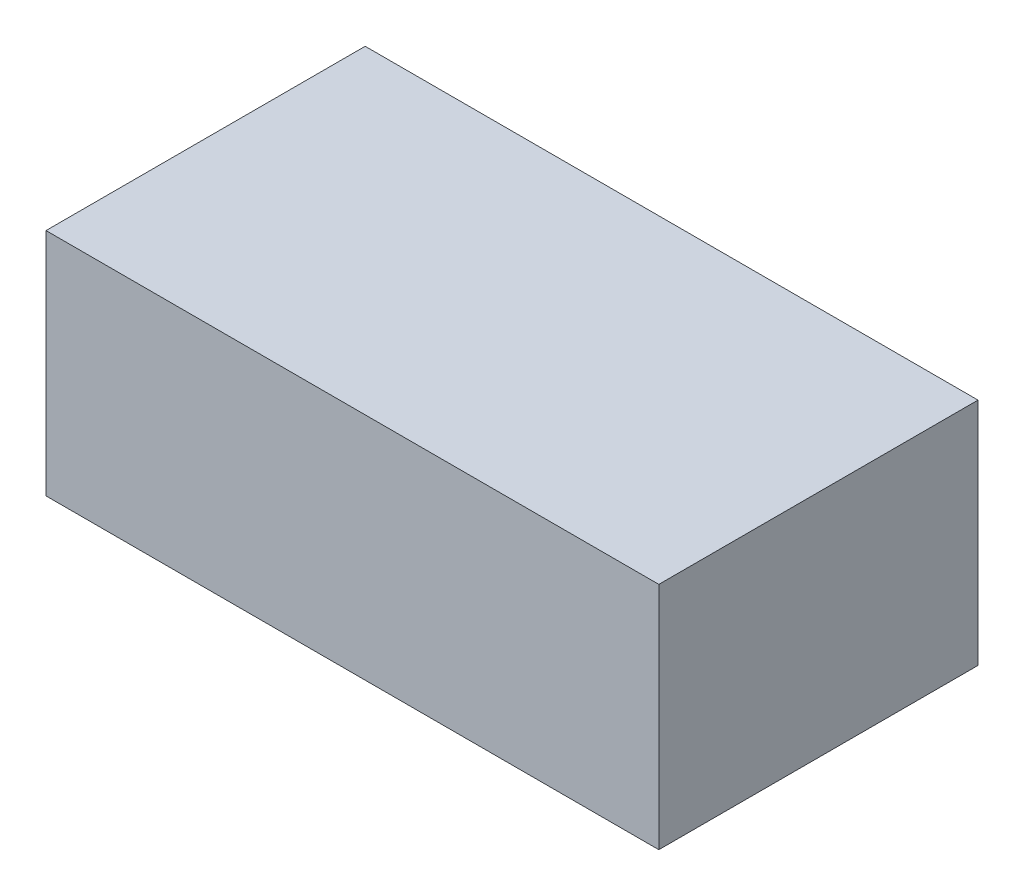
ISO-10303-21;
HEADER;
FILE_DESCRIPTION(('STEP AP214'),'2;1');
FILE_NAME('part.step','',(''),(''),'','','');
FILE_SCHEMA(('AUTOMOTIVE_DESIGN { 1 0 10303 214 1 1 1 1 }'));
ENDSEC;
DATA;
#1=APPLICATION_CONTEXT('core data for automotive mechanical design processes');
#2=APPLICATION_PROTOCOL_DEFINITION('international standard','automotive_design',2000,#1);
#3=PRODUCT_CONTEXT('',#1,'mechanical');
#4=PRODUCT('Part','Part','',(#3));
#5=PRODUCT_RELATED_PRODUCT_CATEGORY('part','',(#4));
#6=PRODUCT_DEFINITION_FORMATION('','',#4);
#7=PRODUCT_DEFINITION_CONTEXT('part definition',#1,'design');
#8=PRODUCT_DEFINITION('design','',#6,#7);
#9=PRODUCT_DEFINITION_SHAPE('','',#8);
#10=(LENGTH_UNIT() NAMED_UNIT(*) SI_UNIT(.MILLI.,.METRE.));
#11=(NAMED_UNIT(*) PLANE_ANGLE_UNIT() SI_UNIT($,.RADIAN.));
#12=(NAMED_UNIT(*) SI_UNIT($,.STERADIAN.) SOLID_ANGLE_UNIT());
#13=UNCERTAINTY_MEASURE_WITH_UNIT(LENGTH_MEASURE(1.E-05),#10,'distance_accuracy_value','');
#14=(GEOMETRIC_REPRESENTATION_CONTEXT(3) GLOBAL_UNCERTAINTY_ASSIGNED_CONTEXT((#13)) GLOBAL_UNIT_ASSIGNED_CONTEXT((#10,
#11,#12)) REPRESENTATION_CONTEXT('',''));
#15=CARTESIAN_POINT('',(0.,0.,0.));
#16=DIRECTION('',(0.,0.,1.));
#17=DIRECTION('',(1.,0.,0.));
#18=AXIS2_PLACEMENT_3D('',#15,#16,#17);
#19=CARTESIAN_POINT('',(-0.48,-0.18,0.));
#20=DIRECTION('',(0.,-1.,0.));
#21=DIRECTION('',(1.,0.,0.));
#22=AXIS2_PLACEMENT_3D('',#19,#20,#21);
#23=PLANE('',#22);
#24=DIRECTION('',(1.,0.,0.));
#25=VECTOR('',#24,1.);
#26=CARTESIAN_POINT('',(-0.48,-0.18,0.));
#27=LINE('',#26,#25);
#28=CARTESIAN_POINT('',(-0.48,-0.18,0.));
#29=VERTEX_POINT('',#28);
#30=CARTESIAN_POINT('',(0.48,-0.18,0.));
#31=VERTEX_POINT('',#30);
#32=EDGE_CURVE('E11',#29,#31,#27,.T.);
#33=ORIENTED_EDGE('',*,*,#32,.T.);
#34=DIRECTION('',(0.,0.,1.));
#35=VECTOR('',#34,1.);
#36=CARTESIAN_POINT('',(0.48,-0.18,0.));
#37=LINE('',#36,#35);
#38=CARTESIAN_POINT('',(0.48,-0.18,0.5));
#39=VERTEX_POINT('',#38);
#40=EDGE_CURVE('E24',#31,#39,#37,.T.);
#41=ORIENTED_EDGE('',*,*,#40,.T.);
#42=DIRECTION('',(1.,0.,0.));
#43=VECTOR('',#42,1.);
#44=CARTESIAN_POINT('',(-0.48,-0.18,0.5));
#45=LINE('',#44,#43);
#46=CARTESIAN_POINT('',(-0.48,-0.18,0.5));
#47=VERTEX_POINT('',#46);
#48=EDGE_CURVE('E75',#47,#39,#45,.T.);
#49=ORIENTED_EDGE('',*,*,#48,.F.);
#50=DIRECTION('',(0.,0.,1.));
#51=VECTOR('',#50,1.);
#52=CARTESIAN_POINT('',(-0.48,-0.18,0.));
#53=LINE('',#52,#51);
#54=EDGE_CURVE('E86',#29,#47,#53,.T.);
#55=ORIENTED_EDGE('',*,*,#54,.F.);
#56=EDGE_LOOP('',(#33,#41,#49,#55));
#57=FACE_BOUND('',#56,.T.);
#58=ADVANCED_FACE('F17',(#57),#23,.T.);
#59=CARTESIAN_POINT('',(-0.48,0.18,0.));
#60=DIRECTION('',(-1.,0.,0.));
#61=DIRECTION('',(0.,-1.,0.));
#62=AXIS2_PLACEMENT_3D('',#59,#60,#61);
#63=PLANE('',#62);
#64=DIRECTION('',(0.,-1.,0.));
#65=VECTOR('',#64,1.);
#66=CARTESIAN_POINT('',(-0.48,0.18,0.));
#67=LINE('',#66,#65);
#68=CARTESIAN_POINT('',(-0.48,0.18,0.));
#69=VERTEX_POINT('',#68);
#70=EDGE_CURVE('E83',#69,#29,#67,.T.);
#71=ORIENTED_EDGE('',*,*,#70,.T.);
#72=ORIENTED_EDGE('',*,*,#54,.T.);
#73=DIRECTION('',(0.,-1.,0.));
#74=VECTOR('',#73,1.);
#75=CARTESIAN_POINT('',(-0.48,0.18,0.5));
#76=LINE('',#75,#74);
#77=CARTESIAN_POINT('',(-0.48,0.18,0.5));
#78=VERTEX_POINT('',#77);
#79=EDGE_CURVE('E81',#78,#47,#76,.T.);
#80=ORIENTED_EDGE('',*,*,#79,.F.);
#81=DIRECTION('',(0.,0.,1.));
#82=VECTOR('',#81,1.);
#83=CARTESIAN_POINT('',(-0.48,0.18,0.));
#84=LINE('',#83,#82);
#85=EDGE_CURVE('E61',#69,#78,#84,.T.);
#86=ORIENTED_EDGE('',*,*,#85,.F.);
#87=EDGE_LOOP('',(#71,#72,#80,#86));
#88=FACE_BOUND('',#87,.T.);
#89=ADVANCED_FACE('F91',(#88),#63,.T.);
#90=CARTESIAN_POINT('',(0.48,0.18,0.));
#91=DIRECTION('',(0.,1.,0.));
#92=DIRECTION('',(-1.,0.,0.));
#93=AXIS2_PLACEMENT_3D('',#90,#91,#92);
#94=PLANE('',#93);
#95=DIRECTION('',(-1.,0.,0.));
#96=VECTOR('',#95,1.);
#97=CARTESIAN_POINT('',(0.48,0.18,0.));
#98=LINE('',#97,#96);
#99=CARTESIAN_POINT('',(0.48,0.18,0.));
#100=VERTEX_POINT('',#99);
#101=EDGE_CURVE('E65',#100,#69,#98,.T.);
#102=ORIENTED_EDGE('',*,*,#101,.T.);
#103=ORIENTED_EDGE('',*,*,#85,.T.);
#104=DIRECTION('',(-1.,0.,0.));
#105=VECTOR('',#104,1.);
#106=CARTESIAN_POINT('',(0.48,0.18,0.5));
#107=LINE('',#106,#105);
#108=CARTESIAN_POINT('',(0.48,0.18,0.5));
#109=VERTEX_POINT('',#108);
#110=EDGE_CURVE('E54',#109,#78,#107,.T.);
#111=ORIENTED_EDGE('',*,*,#110,.F.);
#112=DIRECTION('',(0.,0.,1.));
#113=VECTOR('',#112,1.);
#114=CARTESIAN_POINT('',(0.48,0.18,0.));
#115=LINE('',#114,#113);
#116=EDGE_CURVE('E58',#100,#109,#115,.T.);
#117=ORIENTED_EDGE('',*,*,#116,.F.);
#118=EDGE_LOOP('',(#102,#103,#111,#117));
#119=FACE_BOUND('',#118,.T.);
#120=ADVANCED_FACE('F57',(#119),#94,.T.);
#121=CARTESIAN_POINT('',(0.48,-0.18,0.));
#122=DIRECTION('',(1.,0.,0.));
#123=DIRECTION('',(0.,1.,0.));
#124=AXIS2_PLACEMENT_3D('',#121,#122,#123);
#125=PLANE('',#124);
#126=DIRECTION('',(0.,1.,0.));
#127=VECTOR('',#126,1.);
#128=CARTESIAN_POINT('',(0.48,-0.18,0.));
#129=LINE('',#128,#127);
#130=EDGE_CURVE('E71',#31,#100,#129,.T.);
#131=ORIENTED_EDGE('',*,*,#130,.T.);
#132=ORIENTED_EDGE('',*,*,#116,.T.);
#133=DIRECTION('',(0.,1.,0.));
#134=VECTOR('',#133,1.);
#135=CARTESIAN_POINT('',(0.48,-0.18,0.5));
#136=LINE('',#135,#134);
#137=EDGE_CURVE('E70',#39,#109,#136,.T.);
#138=ORIENTED_EDGE('',*,*,#137,.F.);
#139=ORIENTED_EDGE('',*,*,#40,.F.);
#140=EDGE_LOOP('',(#131,#132,#138,#139));
#141=FACE_BOUND('',#140,.T.);
#142=ADVANCED_FACE('F69',(#141),#125,.T.);
#143=CARTESIAN_POINT('',(0.,0.,0.5));
#144=DIRECTION('',(0.,0.,1.));
#145=DIRECTION('',(1.,0.,0.));
#146=AXIS2_PLACEMENT_3D('',#143,#144,#145);
#147=PLANE('',#146);
#148=ORIENTED_EDGE('',*,*,#137,.T.);
#149=ORIENTED_EDGE('',*,*,#110,.T.);
#150=ORIENTED_EDGE('',*,*,#79,.T.);
#151=ORIENTED_EDGE('',*,*,#48,.T.);
#152=EDGE_LOOP('',(#148,#149,#150,#151));
#153=FACE_BOUND('',#152,.T.);
#154=ADVANCED_FACE('F74',(#153),#147,.T.);
#155=CARTESIAN_POINT('',(0.,0.,0.));
#156=DIRECTION('',(0.,0.,1.));
#157=DIRECTION('',(1.,0.,0.));
#158=AXIS2_PLACEMENT_3D('',#155,#156,#157);
#159=PLANE('',#158);
#160=ORIENTED_EDGE('',*,*,#130,.F.);
#161=ORIENTED_EDGE('',*,*,#32,.F.);
#162=ORIENTED_EDGE('',*,*,#70,.F.);
#163=ORIENTED_EDGE('',*,*,#101,.F.);
#164=EDGE_LOOP('',(#160,#161,#162,#163));
#165=FACE_BOUND('',#164,.T.);
#166=ADVANCED_FACE('F89',(#165),#159,.F.);
#167=CLOSED_SHELL('',(#58,#89,#120,#142,#154,#166));
#168=MANIFOLD_SOLID_BREP('B1',#167);
#169=ADVANCED_BREP_SHAPE_REPRESENTATION('',(#18,#168),#14);
#170=SHAPE_DEFINITION_REPRESENTATION(#9,#169);
ENDSEC;
END-ISO-10303-21;
